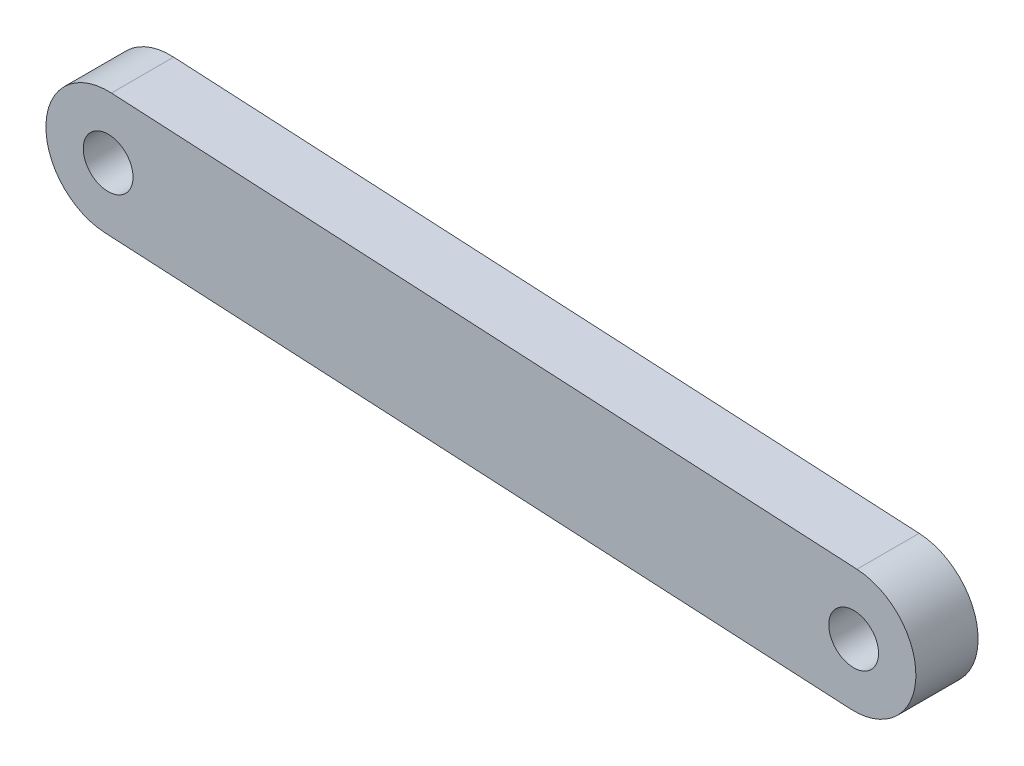
ISO-10303-21;
HEADER;
FILE_DESCRIPTION(('STEP AP214'),'2;1');
FILE_NAME('part.step','',(''),(''),'','','');
FILE_SCHEMA(('AUTOMOTIVE_DESIGN { 1 0 10303 214 1 1 1 1 }'));
ENDSEC;
DATA;
#1=APPLICATION_CONTEXT('core data for automotive mechanical design processes');
#2=APPLICATION_PROTOCOL_DEFINITION('international standard','automotive_design',2000,#1);
#3=PRODUCT_CONTEXT('',#1,'mechanical');
#4=PRODUCT('Part','Part','',(#3));
#5=PRODUCT_RELATED_PRODUCT_CATEGORY('part','',(#4));
#6=PRODUCT_DEFINITION_FORMATION('','',#4);
#7=PRODUCT_DEFINITION_CONTEXT('part definition',#1,'design');
#8=PRODUCT_DEFINITION('design','',#6,#7);
#9=PRODUCT_DEFINITION_SHAPE('','',#8);
#10=(LENGTH_UNIT() NAMED_UNIT(*) SI_UNIT(.MILLI.,.METRE.));
#11=(NAMED_UNIT(*) PLANE_ANGLE_UNIT() SI_UNIT($,.RADIAN.));
#12=(NAMED_UNIT(*) SI_UNIT($,.STERADIAN.) SOLID_ANGLE_UNIT());
#13=UNCERTAINTY_MEASURE_WITH_UNIT(LENGTH_MEASURE(1.E-05),#10,'distance_accuracy_value','');
#14=(GEOMETRIC_REPRESENTATION_CONTEXT(3) GLOBAL_UNCERTAINTY_ASSIGNED_CONTEXT((#13)) GLOBAL_UNIT_ASSIGNED_CONTEXT((#10,
#11,#12)) REPRESENTATION_CONTEXT('',''));
#15=CARTESIAN_POINT('',(0.,0.,0.));
#16=DIRECTION('',(0.,0.,1.));
#17=DIRECTION('',(1.,0.,0.));
#18=AXIS2_PLACEMENT_3D('',#15,#16,#17);
#19=CARTESIAN_POINT('',(-35.5373266073171,-8.81247047670461,-5.));
#20=DIRECTION('',(0.,0.,-1.));
#21=DIRECTION('',(0.,-1.,0.));
#22=AXIS2_PLACEMENT_3D('',#19,#20,#21);
#23=PLANE('',#22);
#24=CARTESIAN_POINT('',(-35.5373266073171,-8.81247047670461,-5.));
#25=DIRECTION('',(0.,0.,1.));
#26=DIRECTION('',(0.,-1.,0.));
#27=AXIS2_PLACEMENT_3D('',#24,#25,#26);
#28=CIRCLE('',#27,2.);
#29=CARTESIAN_POINT('',(-35.5373266073171,-10.8124704767046,-5.));
#30=VERTEX_POINT('',#29);
#31=EDGE_CURVE('E105',#30,#30,#28,.T.);
#32=ORIENTED_EDGE('',*,*,#31,.T.);
#33=EDGE_LOOP('',(#32));
#34=FACE_BOUND('',#33,.T.);
#35=CARTESIAN_POINT('',(-35.5373266073171,-8.81247047670461,-5.));
#36=DIRECTION('',(0.,0.,1.));
#37=DIRECTION('',(0.,-1.,0.));
#38=AXIS2_PLACEMENT_3D('',#35,#36,#37);
#39=CIRCLE('',#38,5.);
#40=CARTESIAN_POINT('',(-35.802717202182,-13.8054222922299,-5.));
#41=VERTEX_POINT('',#40);
#42=CARTESIAN_POINT('',(-35.2719360124522,-3.81951866117932,-5.));
#43=VERTEX_POINT('',#42);
#44=EDGE_CURVE('E93',#41,#43,#39,.T.);
#45=ORIENTED_EDGE('',*,*,#44,.F.);
#46=DIRECTION('',(0.998590363105057,-0.053078118972978,0.));
#47=VECTOR('',#46,1.);
#48=CARTESIAN_POINT('',(-35.802717202182,-13.8054222922299,-5.));
#49=LINE('',#48,#47);
#50=CARTESIAN_POINT('',(-95.7181389884854,-10.6207351538512,-5.));
#51=VERTEX_POINT('',#50);
#52=EDGE_CURVE('E96',#51,#41,#49,.T.);
#53=ORIENTED_EDGE('',*,*,#52,.F.);
#54=CARTESIAN_POINT('',(-95.4527483936205,-5.62778333832594,-5.));
#55=DIRECTION('',(0.,0.,1.));
#56=DIRECTION('',(0.,1.,0.));
#57=AXIS2_PLACEMENT_3D('',#54,#55,#56);
#58=CIRCLE('',#57,4.99999999999999);
#59=CARTESIAN_POINT('',(-95.1873577987556,-0.634831522800653,-5.));
#60=VERTEX_POINT('',#59);
#61=EDGE_CURVE('E84',#60,#51,#58,.T.);
#62=ORIENTED_EDGE('',*,*,#61,.F.);
#63=DIRECTION('',(-0.998590363105057,0.0530781189729777,0.));
#64=VECTOR('',#63,1.);
#65=CARTESIAN_POINT('',(-35.2719360124522,-3.81951866117932,-5.));
#66=LINE('',#65,#64);
#67=EDGE_CURVE('E89',#43,#60,#66,.T.);
#68=ORIENTED_EDGE('',*,*,#67,.F.);
#69=EDGE_LOOP('',(#45,#53,#62,#68));
#70=FACE_BOUND('',#69,.T.);
#71=CARTESIAN_POINT('',(-95.4527483936205,-5.62778333832594,-5.));
#72=DIRECTION('',(0.,0.,1.));
#73=DIRECTION('',(0.,-1.,0.));
#74=AXIS2_PLACEMENT_3D('',#71,#72,#73);
#75=CIRCLE('',#74,2.);
#76=CARTESIAN_POINT('',(-95.4527483936205,-7.62778333832594,-5.));
#77=VERTEX_POINT('',#76);
#78=EDGE_CURVE('E116',#77,#77,#75,.T.);
#79=ORIENTED_EDGE('',*,*,#78,.T.);
#80=EDGE_LOOP('',(#79));
#81=FACE_BOUND('',#80,.T.);
#82=ADVANCED_FACE('F37',(#34,#70,#81),#23,.T.);
#83=CARTESIAN_POINT('',(-35.5373266073171,-8.81247047670461,0.));
#84=DIRECTION('',(0.,0.,-1.));
#85=DIRECTION('',(0.,-1.,0.));
#86=AXIS2_PLACEMENT_3D('',#83,#84,#85);
#87=PLANE('',#86);
#88=CARTESIAN_POINT('',(-35.5373266073171,-8.81247047670461,0.));
#89=DIRECTION('',(0.,0.,1.));
#90=DIRECTION('',(0.,-1.,0.));
#91=AXIS2_PLACEMENT_3D('',#88,#89,#90);
#92=CIRCLE('',#91,5.);
#93=CARTESIAN_POINT('',(-35.802717202182,-13.8054222922299,0.));
#94=VERTEX_POINT('',#93);
#95=CARTESIAN_POINT('',(-35.2719360124522,-3.81951866117932,0.));
#96=VERTEX_POINT('',#95);
#97=EDGE_CURVE('E101',#94,#96,#92,.T.);
#98=ORIENTED_EDGE('',*,*,#97,.T.);
#99=DIRECTION('',(-0.998590363105057,0.0530781189729777,0.));
#100=VECTOR('',#99,1.);
#101=CARTESIAN_POINT('',(-35.2719360124522,-3.81951866117932,0.));
#102=LINE('',#101,#100);
#103=CARTESIAN_POINT('',(-95.1873577987556,-0.634831522800652,0.));
#104=VERTEX_POINT('',#103);
#105=EDGE_CURVE('E104',#96,#104,#102,.T.);
#106=ORIENTED_EDGE('',*,*,#105,.T.);
#107=CARTESIAN_POINT('',(-95.4527483936205,-5.62778333832593,0.));
#108=DIRECTION('',(0.,0.,1.));
#109=DIRECTION('',(0.,1.,0.));
#110=AXIS2_PLACEMENT_3D('',#107,#108,#109);
#111=CIRCLE('',#110,4.99999999999999);
#112=CARTESIAN_POINT('',(-95.7181389884854,-10.6207351538512,0.));
#113=VERTEX_POINT('',#112);
#114=EDGE_CURVE('E87',#104,#113,#111,.T.);
#115=ORIENTED_EDGE('',*,*,#114,.T.);
#116=DIRECTION('',(0.998590363105057,-0.053078118972978,0.));
#117=VECTOR('',#116,1.);
#118=CARTESIAN_POINT('',(-35.802717202182,-13.8054222922299,0.));
#119=LINE('',#118,#117);
#120=EDGE_CURVE('E108',#113,#94,#119,.T.);
#121=ORIENTED_EDGE('',*,*,#120,.T.);
#122=EDGE_LOOP('',(#98,#106,#115,#121));
#123=FACE_BOUND('',#122,.T.);
#124=CARTESIAN_POINT('',(-35.5373266073171,-8.81247047670461,0.));
#125=DIRECTION('',(0.,0.,1.));
#126=DIRECTION('',(0.,-1.,0.));
#127=AXIS2_PLACEMENT_3D('',#124,#125,#126);
#128=CIRCLE('',#127,2.);
#129=CARTESIAN_POINT('',(-35.5373266073171,-10.8124704767046,0.));
#130=VERTEX_POINT('',#129);
#131=EDGE_CURVE('E113',#130,#130,#128,.T.);
#132=ORIENTED_EDGE('',*,*,#131,.F.);
#133=EDGE_LOOP('',(#132));
#134=FACE_BOUND('',#133,.T.);
#135=CARTESIAN_POINT('',(-95.4527483936205,-5.62778333832593,0.));
#136=DIRECTION('',(0.,0.,1.));
#137=DIRECTION('',(0.,-1.,0.));
#138=AXIS2_PLACEMENT_3D('',#135,#136,#137);
#139=CIRCLE('',#138,2.);
#140=CARTESIAN_POINT('',(-95.4527483936205,-7.62778333832594,0.));
#141=VERTEX_POINT('',#140);
#142=EDGE_CURVE('E119',#141,#141,#139,.T.);
#143=ORIENTED_EDGE('',*,*,#142,.F.);
#144=EDGE_LOOP('',(#143));
#145=FACE_BOUND('',#144,.T.);
#146=ADVANCED_FACE('F132',(#123,#134,#145),#87,.F.);
#147=CARTESIAN_POINT('',(-35.5373266073171,-8.81247047670461,-5.));
#148=DIRECTION('',(0.,0.,1.));
#149=DIRECTION('',(0.,1.,0.));
#150=AXIS2_PLACEMENT_3D('',#147,#148,#149);
#151=CYLINDRICAL_SURFACE('',#150,5.);
#152=ORIENTED_EDGE('',*,*,#97,.F.);
#153=DIRECTION('',(0.,0.,1.));
#154=VECTOR('',#153,1.);
#155=CARTESIAN_POINT('',(-35.802717202182,-13.8054222922299,-5.));
#156=LINE('',#155,#154);
#157=EDGE_CURVE('E54',#41,#94,#156,.T.);
#158=ORIENTED_EDGE('',*,*,#157,.F.);
#159=ORIENTED_EDGE('',*,*,#44,.T.);
#160=DIRECTION('',(0.,0.,1.));
#161=VECTOR('',#160,1.);
#162=CARTESIAN_POINT('',(-35.2719360124522,-3.81951866117932,-5.));
#163=LINE('',#162,#161);
#164=EDGE_CURVE('E11',#43,#96,#163,.T.);
#165=ORIENTED_EDGE('',*,*,#164,.T.);
#166=EDGE_LOOP('',(#152,#158,#159,#165));
#167=FACE_BOUND('',#166,.T.);
#168=ADVANCED_FACE('F39',(#167),#151,.T.);
#169=CARTESIAN_POINT('',(-35.2719360124522,-3.81951866117932,-5.));
#170=DIRECTION('',(-0.0530781189729777,-0.998590363105058,0.));
#171=DIRECTION('',(0.998590363105058,-0.0530781189729777,0.));
#172=AXIS2_PLACEMENT_3D('',#169,#170,#171);
#173=PLANE('',#172);
#174=ORIENTED_EDGE('',*,*,#105,.F.);
#175=ORIENTED_EDGE('',*,*,#164,.F.);
#176=ORIENTED_EDGE('',*,*,#67,.T.);
#177=DIRECTION('',(0.,0.,1.));
#178=VECTOR('',#177,1.);
#179=CARTESIAN_POINT('',(-95.1873577987556,-0.634831522800653,-5.));
#180=LINE('',#179,#178);
#181=EDGE_CURVE('E46',#60,#104,#180,.T.);
#182=ORIENTED_EDGE('',*,*,#181,.T.);
#183=EDGE_LOOP('',(#174,#175,#176,#182));
#184=FACE_BOUND('',#183,.T.);
#185=ADVANCED_FACE('F90',(#184),#173,.F.);
#186=CARTESIAN_POINT('',(-95.4527483936205,-5.62778333832594,-5.));
#187=DIRECTION('',(0.,0.,1.));
#188=DIRECTION('',(0.,1.,0.));
#189=AXIS2_PLACEMENT_3D('',#186,#187,#188);
#190=CYLINDRICAL_SURFACE('',#189,4.99999999999999);
#191=ORIENTED_EDGE('',*,*,#114,.F.);
#192=ORIENTED_EDGE('',*,*,#181,.F.);
#193=ORIENTED_EDGE('',*,*,#61,.T.);
#194=DIRECTION('',(0.,0.,1.));
#195=VECTOR('',#194,1.);
#196=CARTESIAN_POINT('',(-95.7181389884854,-10.6207351538512,-5.));
#197=LINE('',#196,#195);
#198=EDGE_CURVE('E70',#51,#113,#197,.T.);
#199=ORIENTED_EDGE('',*,*,#198,.T.);
#200=EDGE_LOOP('',(#191,#192,#193,#199));
#201=FACE_BOUND('',#200,.T.);
#202=ADVANCED_FACE('F82',(#201),#190,.T.);
#203=CARTESIAN_POINT('',(-35.802717202182,-13.8054222922299,-5.));
#204=DIRECTION('',(0.053078118972978,0.998590363105057,0.));
#205=DIRECTION('',(-0.998590363105058,0.053078118972978,0.));
#206=AXIS2_PLACEMENT_3D('',#203,#204,#205);
#207=PLANE('',#206);
#208=ORIENTED_EDGE('',*,*,#120,.F.);
#209=ORIENTED_EDGE('',*,*,#198,.F.);
#210=ORIENTED_EDGE('',*,*,#52,.T.);
#211=ORIENTED_EDGE('',*,*,#157,.T.);
#212=EDGE_LOOP('',(#208,#209,#210,#211));
#213=FACE_BOUND('',#212,.T.);
#214=ADVANCED_FACE('F144',(#213),#207,.F.);
#215=CARTESIAN_POINT('',(-35.5373266073171,-8.81247047670461,-5.));
#216=DIRECTION('',(0.,0.,1.));
#217=DIRECTION('',(0.,1.,0.));
#218=AXIS2_PLACEMENT_3D('',#215,#216,#217);
#219=CYLINDRICAL_SURFACE('',#218,2.);
#220=ORIENTED_EDGE('',*,*,#31,.F.);
#221=EDGE_LOOP('',(#220));
#222=FACE_BOUND('',#221,.T.);
#223=ORIENTED_EDGE('',*,*,#131,.T.);
#224=EDGE_LOOP('',(#223));
#225=FACE_BOUND('',#224,.T.);
#226=ADVANCED_FACE('F128',(#222,#225),#219,.F.);
#227=CARTESIAN_POINT('',(-95.4527483936205,-5.62778333832594,-5.));
#228=DIRECTION('',(0.,0.,1.));
#229=DIRECTION('',(0.,1.,0.));
#230=AXIS2_PLACEMENT_3D('',#227,#228,#229);
#231=CYLINDRICAL_SURFACE('',#230,2.);
#232=ORIENTED_EDGE('',*,*,#78,.F.);
#233=EDGE_LOOP('',(#232));
#234=FACE_BOUND('',#233,.T.);
#235=ORIENTED_EDGE('',*,*,#142,.T.);
#236=EDGE_LOOP('',(#235));
#237=FACE_BOUND('',#236,.T.);
#238=ADVANCED_FACE('F125',(#234,#237),#231,.F.);
#239=CLOSED_SHELL('',(#82,#146,#168,#185,#202,#214,#226,#238));
#240=MANIFOLD_SOLID_BREP('B2',#239);
#241=ADVANCED_BREP_SHAPE_REPRESENTATION('',(#18,#240),#14);
#242=SHAPE_DEFINITION_REPRESENTATION(#9,#241);
ENDSEC;
END-ISO-10303-21;
